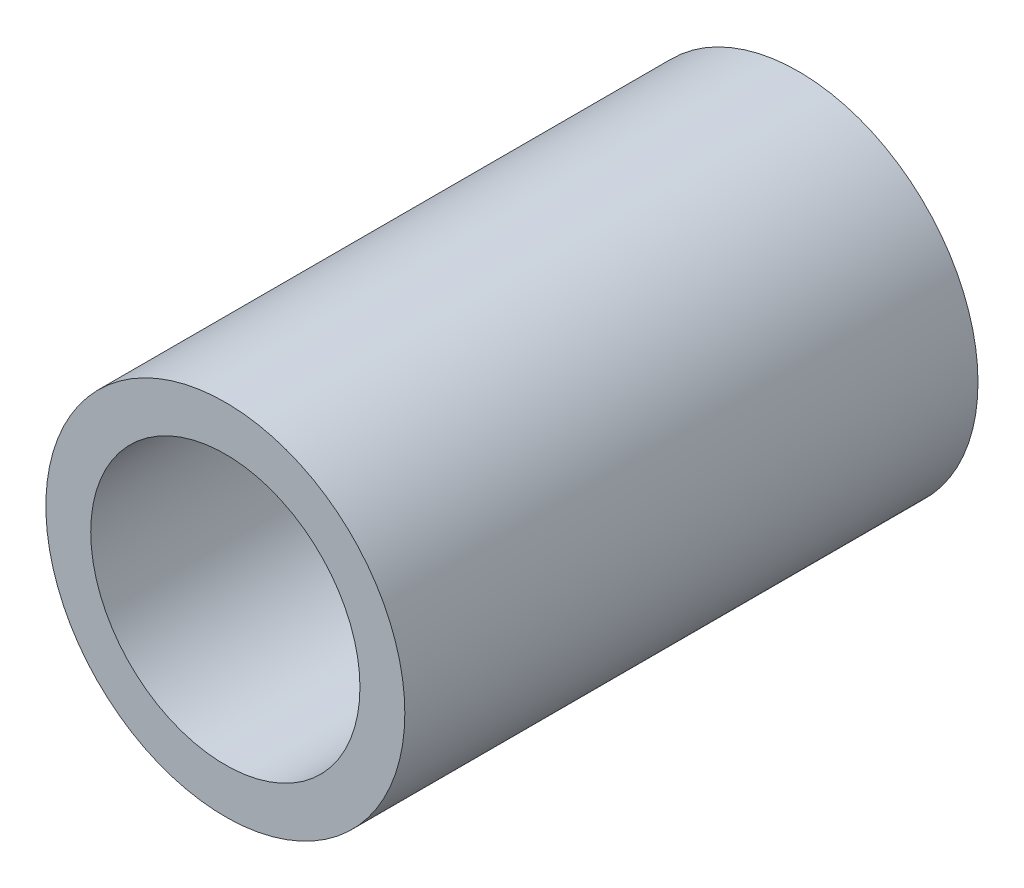
ISO-10303-21;
HEADER;
FILE_DESCRIPTION(('STEP AP214'),'2;1');
FILE_NAME('part.step','',(''),(''),'','','');
FILE_SCHEMA(('AUTOMOTIVE_DESIGN { 1 0 10303 214 1 1 1 1 }'));
ENDSEC;
DATA;
#1=APPLICATION_CONTEXT('core data for automotive mechanical design processes');
#2=APPLICATION_PROTOCOL_DEFINITION('international standard','automotive_design',2000,#1);
#3=PRODUCT_CONTEXT('',#1,'mechanical');
#4=PRODUCT('Part','Part','',(#3));
#5=PRODUCT_RELATED_PRODUCT_CATEGORY('part','',(#4));
#6=PRODUCT_DEFINITION_FORMATION('','',#4);
#7=PRODUCT_DEFINITION_CONTEXT('part definition',#1,'design');
#8=PRODUCT_DEFINITION('design','',#6,#7);
#9=PRODUCT_DEFINITION_SHAPE('','',#8);
#10=(LENGTH_UNIT() NAMED_UNIT(*) SI_UNIT(.MILLI.,.METRE.));
#11=(NAMED_UNIT(*) PLANE_ANGLE_UNIT() SI_UNIT($,.RADIAN.));
#12=(NAMED_UNIT(*) SI_UNIT($,.STERADIAN.) SOLID_ANGLE_UNIT());
#13=UNCERTAINTY_MEASURE_WITH_UNIT(LENGTH_MEASURE(1.E-05),#10,'distance_accuracy_value','');
#14=(GEOMETRIC_REPRESENTATION_CONTEXT(3) GLOBAL_UNCERTAINTY_ASSIGNED_CONTEXT((#13)) GLOBAL_UNIT_ASSIGNED_CONTEXT((#10,
#11,#12)) REPRESENTATION_CONTEXT('',''));
#15=CARTESIAN_POINT('',(0.,0.,0.));
#16=DIRECTION('',(0.,0.,1.));
#17=DIRECTION('',(1.,0.,0.));
#18=AXIS2_PLACEMENT_3D('',#15,#16,#17);
#19=CARTESIAN_POINT('',(0.,0.,60.833));
#20=DIRECTION('',(0.,0.,1.));
#21=DIRECTION('',(1.,0.,0.));
#22=AXIS2_PLACEMENT_3D('',#19,#20,#21);
#23=PLANE('',#22);
#24=CARTESIAN_POINT('',(0.,0.,60.833));
#25=DIRECTION('',(0.,0.,1.));
#26=DIRECTION('',(1.,0.,0.));
#27=AXIS2_PLACEMENT_3D('',#24,#25,#26);
#28=CIRCLE('',#27,38.1);
#29=CARTESIAN_POINT('',(38.1,0.,60.833));
#30=VERTEX_POINT('',#29);
#31=EDGE_CURVE('E10',#30,#30,#28,.T.);
#32=ORIENTED_EDGE('',*,*,#31,.T.);
#33=EDGE_LOOP('',(#32));
#34=FACE_BOUND('',#33,.T.);
#35=CARTESIAN_POINT('',(0.,0.,60.833));
#36=DIRECTION('',(0.,0.,1.));
#37=DIRECTION('',(1.,0.,0.));
#38=AXIS2_PLACEMENT_3D('',#35,#36,#37);
#39=CIRCLE('',#38,28.575);
#40=CARTESIAN_POINT('',(28.575,0.,60.833));
#41=VERTEX_POINT('',#40);
#42=EDGE_CURVE('E48',#41,#41,#39,.T.);
#43=ORIENTED_EDGE('',*,*,#42,.F.);
#44=EDGE_LOOP('',(#43));
#45=FACE_BOUND('',#44,.T.);
#46=ADVANCED_FACE('F37',(#34,#45),#23,.T.);
#47=CARTESIAN_POINT('',(0.,0.,-60.833));
#48=DIRECTION('',(0.,0.,1.));
#49=DIRECTION('',(1.,0.,0.));
#50=AXIS2_PLACEMENT_3D('',#47,#48,#49);
#51=PLANE('',#50);
#52=CARTESIAN_POINT('',(0.,0.,-60.833));
#53=DIRECTION('',(0.,0.,1.));
#54=DIRECTION('',(1.,0.,0.));
#55=AXIS2_PLACEMENT_3D('',#52,#53,#54);
#56=CIRCLE('',#55,38.1);
#57=CARTESIAN_POINT('',(38.1,0.,-60.833));
#58=VERTEX_POINT('',#57);
#59=EDGE_CURVE('E41',#58,#58,#56,.T.);
#60=ORIENTED_EDGE('',*,*,#59,.F.);
#61=EDGE_LOOP('',(#60));
#62=FACE_BOUND('',#61,.T.);
#63=CARTESIAN_POINT('',(0.,0.,-60.833));
#64=DIRECTION('',(0.,0.,1.));
#65=DIRECTION('',(1.,0.,0.));
#66=AXIS2_PLACEMENT_3D('',#63,#64,#65);
#67=CIRCLE('',#66,28.575);
#68=CARTESIAN_POINT('',(28.575,0.,-60.833));
#69=VERTEX_POINT('',#68);
#70=EDGE_CURVE('E50',#69,#69,#67,.T.);
#71=ORIENTED_EDGE('',*,*,#70,.T.);
#72=EDGE_LOOP('',(#71));
#73=FACE_BOUND('',#72,.T.);
#74=ADVANCED_FACE('F60',(#62,#73),#51,.F.);
#75=CARTESIAN_POINT('',(0.,0.,60.833));
#76=DIRECTION('',(0.,0.,-1.));
#77=DIRECTION('',(-1.,0.,0.));
#78=AXIS2_PLACEMENT_3D('',#75,#76,#77);
#79=CYLINDRICAL_SURFACE('',#78,38.1);
#80=ORIENTED_EDGE('',*,*,#31,.F.);
#81=EDGE_LOOP('',(#80));
#82=FACE_BOUND('',#81,.T.);
#83=ORIENTED_EDGE('',*,*,#59,.T.);
#84=EDGE_LOOP('',(#83));
#85=FACE_BOUND('',#84,.T.);
#86=ADVANCED_FACE('F39',(#82,#85),#79,.T.);
#87=CARTESIAN_POINT('',(0.,0.,60.833));
#88=DIRECTION('',(0.,0.,-1.));
#89=DIRECTION('',(-1.,0.,0.));
#90=AXIS2_PLACEMENT_3D('',#87,#88,#89);
#91=CYLINDRICAL_SURFACE('',#90,28.575);
#92=ORIENTED_EDGE('',*,*,#42,.T.);
#93=EDGE_LOOP('',(#92));
#94=FACE_BOUND('',#93,.T.);
#95=ORIENTED_EDGE('',*,*,#70,.F.);
#96=EDGE_LOOP('',(#95));
#97=FACE_BOUND('',#96,.T.);
#98=ADVANCED_FACE('F56',(#94,#97),#91,.F.);
#99=CLOSED_SHELL('',(#46,#74,#86,#98));
#100=MANIFOLD_SOLID_BREP('B2',#99);
#101=ADVANCED_BREP_SHAPE_REPRESENTATION('',(#18,#100),#14);
#102=SHAPE_DEFINITION_REPRESENTATION(#9,#101);
ENDSEC;
END-ISO-10303-21;
